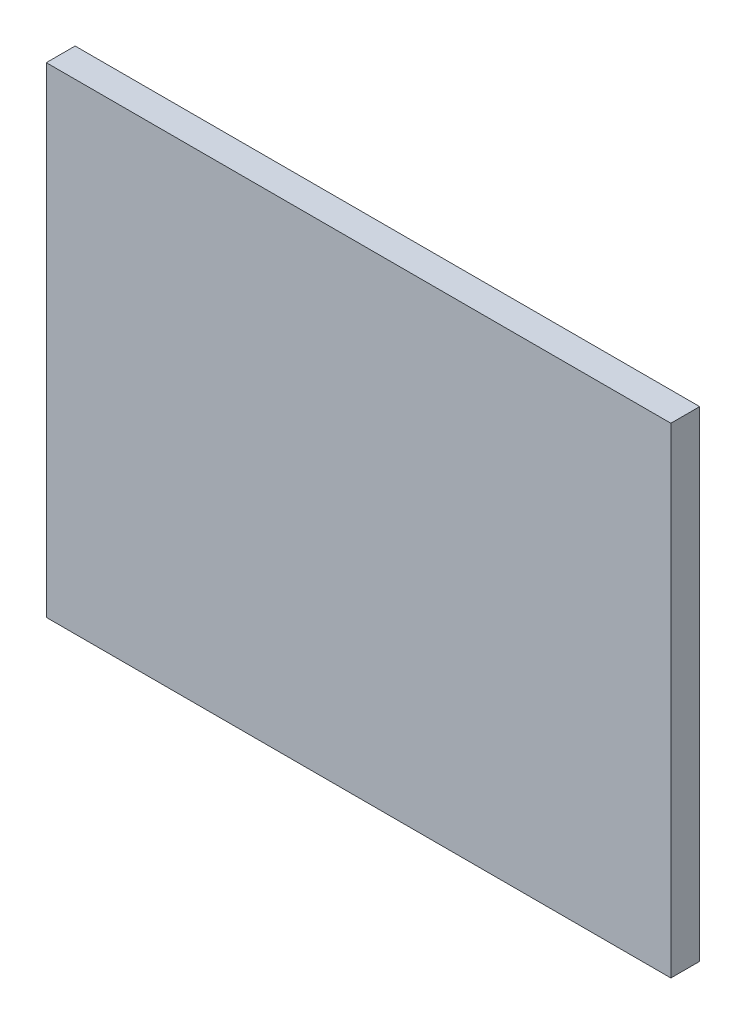
ISO-10303-21;
HEADER;
FILE_DESCRIPTION(('STEP AP214'),'2;1');
FILE_NAME('part.step','',(''),(''),'','','');
FILE_SCHEMA(('AUTOMOTIVE_DESIGN { 1 0 10303 214 1 1 1 1 }'));
ENDSEC;
DATA;
#1=APPLICATION_CONTEXT('core data for automotive mechanical design processes');
#2=APPLICATION_PROTOCOL_DEFINITION('international standard','automotive_design',2000,#1);
#3=PRODUCT_CONTEXT('',#1,'mechanical');
#4=PRODUCT('Part','Part','',(#3));
#5=PRODUCT_RELATED_PRODUCT_CATEGORY('part','',(#4));
#6=PRODUCT_DEFINITION_FORMATION('','',#4);
#7=PRODUCT_DEFINITION_CONTEXT('part definition',#1,'design');
#8=PRODUCT_DEFINITION('design','',#6,#7);
#9=PRODUCT_DEFINITION_SHAPE('','',#8);
#10=(LENGTH_UNIT() NAMED_UNIT(*) SI_UNIT(.MILLI.,.METRE.));
#11=(NAMED_UNIT(*) PLANE_ANGLE_UNIT() SI_UNIT($,.RADIAN.));
#12=(NAMED_UNIT(*) SI_UNIT($,.STERADIAN.) SOLID_ANGLE_UNIT());
#13=UNCERTAINTY_MEASURE_WITH_UNIT(LENGTH_MEASURE(1.E-05),#10,'distance_accuracy_value','');
#14=(GEOMETRIC_REPRESENTATION_CONTEXT(3) GLOBAL_UNCERTAINTY_ASSIGNED_CONTEXT((#13)) GLOBAL_UNIT_ASSIGNED_CONTEXT((#10,
#11,#12)) REPRESENTATION_CONTEXT('',''));
#15=CARTESIAN_POINT('',(0.,0.,0.));
#16=DIRECTION('',(0.,0.,1.));
#17=DIRECTION('',(1.,0.,0.));
#18=AXIS2_PLACEMENT_3D('',#15,#16,#17);
#19=CARTESIAN_POINT('',(-65.,50.,3.));
#20=DIRECTION('',(1.,0.,0.));
#21=DIRECTION('',(0.,1.,0.));
#22=AXIS2_PLACEMENT_3D('',#19,#20,#21);
#23=PLANE('',#22);
#24=DIRECTION('',(0.,-1.,0.));
#25=VECTOR('',#24,1.);
#26=CARTESIAN_POINT('',(-65.,50.,0.));
#27=LINE('',#26,#25);
#28=CARTESIAN_POINT('',(-65.,50.,0.));
#29=VERTEX_POINT('',#28);
#30=CARTESIAN_POINT('',(-65.,0.,0.));
#31=VERTEX_POINT('',#30);
#32=EDGE_CURVE('E96',#29,#31,#27,.T.);
#33=ORIENTED_EDGE('',*,*,#32,.T.);
#34=DIRECTION('',(0.,0.,-1.));
#35=VECTOR('',#34,1.);
#36=CARTESIAN_POINT('',(-65.,0.,3.));
#37=LINE('',#36,#35);
#38=CARTESIAN_POINT('',(-65.,0.,3.));
#39=VERTEX_POINT('',#38);
#40=EDGE_CURVE('E11',#39,#31,#37,.T.);
#41=ORIENTED_EDGE('',*,*,#40,.F.);
#42=DIRECTION('',(0.,-1.,0.));
#43=VECTOR('',#42,1.);
#44=CARTESIAN_POINT('',(-65.,50.,3.));
#45=LINE('',#44,#43);
#46=CARTESIAN_POINT('',(-65.,50.,3.));
#47=VERTEX_POINT('',#46);
#48=EDGE_CURVE('E84',#47,#39,#45,.T.);
#49=ORIENTED_EDGE('',*,*,#48,.F.);
#50=DIRECTION('',(0.,0.,-1.));
#51=VECTOR('',#50,1.);
#52=CARTESIAN_POINT('',(-65.,50.,3.));
#53=LINE('',#52,#51);
#54=EDGE_CURVE('E92',#47,#29,#53,.T.);
#55=ORIENTED_EDGE('',*,*,#54,.T.);
#56=EDGE_LOOP('',(#33,#41,#49,#55));
#57=FACE_BOUND('',#56,.T.);
#58=ADVANCED_FACE('F33',(#57),#23,.F.);
#59=CARTESIAN_POINT('',(-65.,0.,3.));
#60=DIRECTION('',(0.,1.,0.));
#61=DIRECTION('',(0.,0.,1.));
#62=AXIS2_PLACEMENT_3D('',#59,#60,#61);
#63=PLANE('',#62);
#64=DIRECTION('',(1.,0.,0.));
#65=VECTOR('',#64,1.);
#66=CARTESIAN_POINT('',(-65.,0.,0.));
#67=LINE('',#66,#65);
#68=CARTESIAN_POINT('',(0.,0.,0.));
#69=VERTEX_POINT('',#68);
#70=EDGE_CURVE('E88',#31,#69,#67,.T.);
#71=ORIENTED_EDGE('',*,*,#70,.T.);
#72=DIRECTION('',(0.,0.,-1.));
#73=VECTOR('',#72,1.);
#74=CARTESIAN_POINT('',(0.,0.,3.));
#75=LINE('',#74,#73);
#76=CARTESIAN_POINT('',(0.,0.,3.));
#77=VERTEX_POINT('',#76);
#78=EDGE_CURVE('E41',#77,#69,#75,.T.);
#79=ORIENTED_EDGE('',*,*,#78,.F.);
#80=DIRECTION('',(1.,0.,0.));
#81=VECTOR('',#80,1.);
#82=CARTESIAN_POINT('',(-65.,0.,3.));
#83=LINE('',#82,#81);
#84=EDGE_CURVE('E79',#39,#77,#83,.T.);
#85=ORIENTED_EDGE('',*,*,#84,.F.);
#86=ORIENTED_EDGE('',*,*,#40,.T.);
#87=EDGE_LOOP('',(#71,#79,#85,#86));
#88=FACE_BOUND('',#87,.T.);
#89=ADVANCED_FACE('F87',(#88),#63,.F.);
#90=CARTESIAN_POINT('',(0.,50.,3.));
#91=DIRECTION('',(-1.,0.,0.));
#92=DIRECTION('',(0.,0.,1.));
#93=AXIS2_PLACEMENT_3D('',#90,#91,#92);
#94=PLANE('',#93);
#95=DIRECTION('',(0.,1.,0.));
#96=VECTOR('',#95,1.);
#97=CARTESIAN_POINT('',(0.,50.,0.));
#98=LINE('',#97,#96);
#99=CARTESIAN_POINT('',(0.,50.,0.));
#100=VERTEX_POINT('',#99);
#101=EDGE_CURVE('E66',#69,#100,#98,.T.);
#102=ORIENTED_EDGE('',*,*,#101,.T.);
#103=DIRECTION('',(0.,0.,-1.));
#104=VECTOR('',#103,1.);
#105=CARTESIAN_POINT('',(0.,50.,3.));
#106=LINE('',#105,#104);
#107=CARTESIAN_POINT('',(0.,50.,3.));
#108=VERTEX_POINT('',#107);
#109=EDGE_CURVE('E89',#108,#100,#106,.T.);
#110=ORIENTED_EDGE('',*,*,#109,.F.);
#111=DIRECTION('',(0.,1.,0.));
#112=VECTOR('',#111,1.);
#113=CARTESIAN_POINT('',(0.,50.,3.));
#114=LINE('',#113,#112);
#115=EDGE_CURVE('E82',#77,#108,#114,.T.);
#116=ORIENTED_EDGE('',*,*,#115,.F.);
#117=ORIENTED_EDGE('',*,*,#78,.T.);
#118=EDGE_LOOP('',(#102,#110,#116,#117));
#119=FACE_BOUND('',#118,.T.);
#120=ADVANCED_FACE('F90',(#119),#94,.F.);
#121=CARTESIAN_POINT('',(-65.,50.,3.));
#122=DIRECTION('',(0.,-1.,0.));
#123=DIRECTION('',(1.,0.,0.));
#124=AXIS2_PLACEMENT_3D('',#121,#122,#123);
#125=PLANE('',#124);
#126=DIRECTION('',(-1.,0.,0.));
#127=VECTOR('',#126,1.);
#128=CARTESIAN_POINT('',(-65.,50.,0.));
#129=LINE('',#128,#127);
#130=EDGE_CURVE('E72',#100,#29,#129,.T.);
#131=ORIENTED_EDGE('',*,*,#130,.T.);
#132=ORIENTED_EDGE('',*,*,#54,.F.);
#133=DIRECTION('',(-1.,0.,0.));
#134=VECTOR('',#133,1.);
#135=CARTESIAN_POINT('',(-65.,50.,3.));
#136=LINE('',#135,#134);
#137=EDGE_CURVE('E49',#108,#47,#136,.T.);
#138=ORIENTED_EDGE('',*,*,#137,.F.);
#139=ORIENTED_EDGE('',*,*,#109,.T.);
#140=EDGE_LOOP('',(#131,#132,#138,#139));
#141=FACE_BOUND('',#140,.T.);
#142=ADVANCED_FACE('F103',(#141),#125,.F.);
#143=CARTESIAN_POINT('',(0.,0.,3.));
#144=DIRECTION('',(0.,0.,1.));
#145=DIRECTION('',(1.,0.,0.));
#146=AXIS2_PLACEMENT_3D('',#143,#144,#145);
#147=PLANE('',#146);
#148=ORIENTED_EDGE('',*,*,#48,.T.);
#149=ORIENTED_EDGE('',*,*,#84,.T.);
#150=ORIENTED_EDGE('',*,*,#115,.T.);
#151=ORIENTED_EDGE('',*,*,#137,.T.);
#152=EDGE_LOOP('',(#148,#149,#150,#151));
#153=FACE_BOUND('',#152,.T.);
#154=ADVANCED_FACE('F80',(#153),#147,.T.);
#155=CARTESIAN_POINT('',(0.,0.,0.));
#156=DIRECTION('',(0.,0.,1.));
#157=DIRECTION('',(1.,0.,0.));
#158=AXIS2_PLACEMENT_3D('',#155,#156,#157);
#159=PLANE('',#158);
#160=ORIENTED_EDGE('',*,*,#32,.F.);
#161=ORIENTED_EDGE('',*,*,#130,.F.);
#162=ORIENTED_EDGE('',*,*,#101,.F.);
#163=ORIENTED_EDGE('',*,*,#70,.F.);
#164=EDGE_LOOP('',(#160,#161,#162,#163));
#165=FACE_BOUND('',#164,.T.);
#166=ADVANCED_FACE('F106',(#165),#159,.F.);
#167=CLOSED_SHELL('',(#58,#89,#120,#142,#154,#166));
#168=MANIFOLD_SOLID_BREP('B2',#167);
#169=ADVANCED_BREP_SHAPE_REPRESENTATION('',(#18,#168),#14);
#170=SHAPE_DEFINITION_REPRESENTATION(#9,#169);
ENDSEC;
END-ISO-10303-21;
